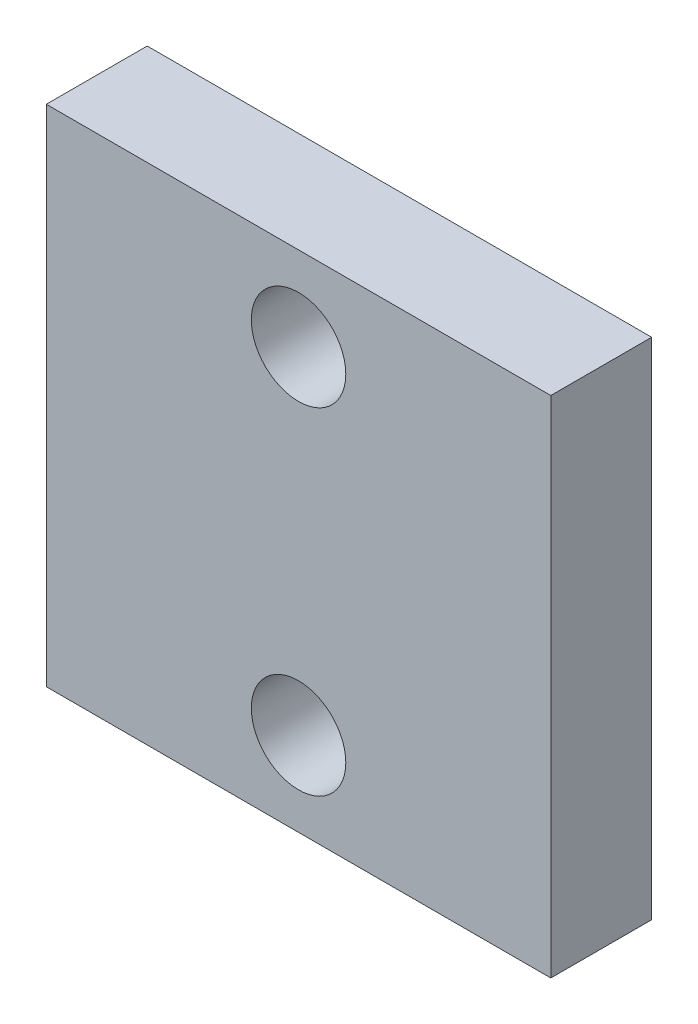
ISO-10303-21;
HEADER;
FILE_DESCRIPTION(('STEP AP214'),'2;1');
FILE_NAME('part.step','',(''),(''),'','','');
FILE_SCHEMA(('AUTOMOTIVE_DESIGN { 1 0 10303 214 1 1 1 1 }'));
ENDSEC;
DATA;
#1=APPLICATION_CONTEXT('core data for automotive mechanical design processes');
#2=APPLICATION_PROTOCOL_DEFINITION('international standard','automotive_design',2000,#1);
#3=PRODUCT_CONTEXT('',#1,'mechanical');
#4=PRODUCT('Part','Part','',(#3));
#5=PRODUCT_RELATED_PRODUCT_CATEGORY('part','',(#4));
#6=PRODUCT_DEFINITION_FORMATION('','',#4);
#7=PRODUCT_DEFINITION_CONTEXT('part definition',#1,'design');
#8=PRODUCT_DEFINITION('design','',#6,#7);
#9=PRODUCT_DEFINITION_SHAPE('','',#8);
#10=(LENGTH_UNIT() NAMED_UNIT(*) SI_UNIT(.MILLI.,.METRE.));
#11=(NAMED_UNIT(*) PLANE_ANGLE_UNIT() SI_UNIT($,.RADIAN.));
#12=(NAMED_UNIT(*) SI_UNIT($,.STERADIAN.) SOLID_ANGLE_UNIT());
#13=UNCERTAINTY_MEASURE_WITH_UNIT(LENGTH_MEASURE(1.E-05),#10,'distance_accuracy_value','');
#14=(GEOMETRIC_REPRESENTATION_CONTEXT(3) GLOBAL_UNCERTAINTY_ASSIGNED_CONTEXT((#13)) GLOBAL_UNIT_ASSIGNED_CONTEXT((#10,
#11,#12)) REPRESENTATION_CONTEXT('',''));
#15=CARTESIAN_POINT('',(0.,0.,0.));
#16=DIRECTION('',(0.,0.,1.));
#17=DIRECTION('',(1.,0.,0.));
#18=AXIS2_PLACEMENT_3D('',#15,#16,#17);
#19=CARTESIAN_POINT('',(0.,0.,12.));
#20=DIRECTION('',(0.,0.,-1.));
#21=DIRECTION('',(-1.,0.,0.));
#22=AXIS2_PLACEMENT_3D('',#19,#20,#21);
#23=PLANE('',#22);
#24=DIRECTION('',(0.,1.,0.));
#25=VECTOR('',#24,1.);
#26=CARTESIAN_POINT('',(30.,-30.,12.));
#27=LINE('',#26,#25);
#28=CARTESIAN_POINT('',(30.,-30.,12.));
#29=VERTEX_POINT('',#28);
#30=CARTESIAN_POINT('',(30.,30.,12.));
#31=VERTEX_POINT('',#30);
#32=EDGE_CURVE('E92',#29,#31,#27,.T.);
#33=ORIENTED_EDGE('',*,*,#32,.T.);
#34=DIRECTION('',(-1.,0.,0.));
#35=VECTOR('',#34,1.);
#36=CARTESIAN_POINT('',(-30.,30.,12.));
#37=LINE('',#36,#35);
#38=CARTESIAN_POINT('',(-30.,30.,12.));
#39=VERTEX_POINT('',#38);
#40=EDGE_CURVE('E87',#31,#39,#37,.T.);
#41=ORIENTED_EDGE('',*,*,#40,.T.);
#42=DIRECTION('',(0.,-1.,0.));
#43=VECTOR('',#42,1.);
#44=CARTESIAN_POINT('',(-30.,-30.,12.));
#45=LINE('',#44,#43);
#46=CARTESIAN_POINT('',(-30.,-30.,12.));
#47=VERTEX_POINT('',#46);
#48=EDGE_CURVE('E90',#39,#47,#45,.T.);
#49=ORIENTED_EDGE('',*,*,#48,.T.);
#50=DIRECTION('',(1.,0.,0.));
#51=VECTOR('',#50,1.);
#52=CARTESIAN_POINT('',(-30.,-30.,12.));
#53=LINE('',#52,#51);
#54=EDGE_CURVE('E57',#47,#29,#53,.T.);
#55=ORIENTED_EDGE('',*,*,#54,.T.);
#56=EDGE_LOOP('',(#33,#41,#49,#55));
#57=FACE_BOUND('',#56,.T.);
#58=CARTESIAN_POINT('',(0.,20.,12.));
#59=DIRECTION('',(0.,0.,1.));
#60=DIRECTION('',(1.,0.,0.));
#61=AXIS2_PLACEMENT_3D('',#58,#59,#60);
#62=CIRCLE('',#61,5.61862085023447);
#63=CARTESIAN_POINT('',(5.61862085023447,20.,12.));
#64=VERTEX_POINT('',#63);
#65=EDGE_CURVE('E112',#64,#64,#62,.T.);
#66=ORIENTED_EDGE('',*,*,#65,.F.);
#67=EDGE_LOOP('',(#66));
#68=FACE_BOUND('',#67,.T.);
#69=CARTESIAN_POINT('',(0.,-20.,12.));
#70=DIRECTION('',(0.,0.,1.));
#71=DIRECTION('',(1.,0.,0.));
#72=AXIS2_PLACEMENT_3D('',#69,#70,#71);
#73=CIRCLE('',#72,5.61862085023445);
#74=CARTESIAN_POINT('',(5.61862085023446,-20.,12.));
#75=VERTEX_POINT('',#74);
#76=EDGE_CURVE('E134',#75,#75,#73,.T.);
#77=ORIENTED_EDGE('',*,*,#76,.F.);
#78=EDGE_LOOP('',(#77));
#79=FACE_BOUND('',#78,.T.);
#80=ADVANCED_FACE('F39',(#57,#68,#79),#23,.F.);
#81=CARTESIAN_POINT('',(0.,0.,0.));
#82=DIRECTION('',(0.,0.,-1.));
#83=DIRECTION('',(-1.,0.,0.));
#84=AXIS2_PLACEMENT_3D('',#81,#82,#83);
#85=PLANE('',#84);
#86=CARTESIAN_POINT('',(0.,20.,0.));
#87=DIRECTION('',(0.,0.,1.));
#88=DIRECTION('',(1.,0.,0.));
#89=AXIS2_PLACEMENT_3D('',#86,#87,#88);
#90=CIRCLE('',#89,5.61862085023447);
#91=CARTESIAN_POINT('',(5.61862085023447,20.,0.));
#92=VERTEX_POINT('',#91);
#93=EDGE_CURVE('E130',#92,#92,#90,.T.);
#94=ORIENTED_EDGE('',*,*,#93,.T.);
#95=EDGE_LOOP('',(#94));
#96=FACE_BOUND('',#95,.T.);
#97=DIRECTION('',(0.,1.,0.));
#98=VECTOR('',#97,1.);
#99=CARTESIAN_POINT('',(30.,-30.,0.));
#100=LINE('',#99,#98);
#101=CARTESIAN_POINT('',(30.,-30.,0.));
#102=VERTEX_POINT('',#101);
#103=CARTESIAN_POINT('',(30.,30.,0.));
#104=VERTEX_POINT('',#103);
#105=EDGE_CURVE('E108',#102,#104,#100,.T.);
#106=ORIENTED_EDGE('',*,*,#105,.F.);
#107=DIRECTION('',(1.,0.,0.));
#108=VECTOR('',#107,1.);
#109=CARTESIAN_POINT('',(-30.,-30.,0.));
#110=LINE('',#109,#108);
#111=CARTESIAN_POINT('',(-30.,-30.,0.));
#112=VERTEX_POINT('',#111);
#113=EDGE_CURVE('E80',#112,#102,#110,.T.);
#114=ORIENTED_EDGE('',*,*,#113,.F.);
#115=DIRECTION('',(0.,-1.,0.));
#116=VECTOR('',#115,1.);
#117=CARTESIAN_POINT('',(-30.,-30.,0.));
#118=LINE('',#117,#116);
#119=CARTESIAN_POINT('',(-30.,30.,0.));
#120=VERTEX_POINT('',#119);
#121=EDGE_CURVE('E74',#120,#112,#118,.T.);
#122=ORIENTED_EDGE('',*,*,#121,.F.);
#123=DIRECTION('',(-1.,0.,0.));
#124=VECTOR('',#123,1.);
#125=CARTESIAN_POINT('',(-30.,30.,0.));
#126=LINE('',#125,#124);
#127=EDGE_CURVE('E97',#104,#120,#126,.T.);
#128=ORIENTED_EDGE('',*,*,#127,.F.);
#129=EDGE_LOOP('',(#106,#114,#122,#128));
#130=FACE_BOUND('',#129,.T.);
#131=CARTESIAN_POINT('',(0.,-20.,0.));
#132=DIRECTION('',(0.,0.,1.));
#133=DIRECTION('',(1.,0.,0.));
#134=AXIS2_PLACEMENT_3D('',#131,#132,#133);
#135=CIRCLE('',#134,5.61862085023445);
#136=CARTESIAN_POINT('',(5.61862085023446,-20.,0.));
#137=VERTEX_POINT('',#136);
#138=EDGE_CURVE('E138',#137,#137,#135,.T.);
#139=ORIENTED_EDGE('',*,*,#138,.T.);
#140=EDGE_LOOP('',(#139));
#141=FACE_BOUND('',#140,.T.);
#142=ADVANCED_FACE('F125',(#96,#130,#141),#85,.T.);
#143=CARTESIAN_POINT('',(30.,-30.,12.));
#144=DIRECTION('',(-1.,0.,0.));
#145=DIRECTION('',(0.,0.,1.));
#146=AXIS2_PLACEMENT_3D('',#143,#144,#145);
#147=PLANE('',#146);
#148=ORIENTED_EDGE('',*,*,#105,.T.);
#149=DIRECTION('',(0.,0.,-1.));
#150=VECTOR('',#149,1.);
#151=CARTESIAN_POINT('',(30.,30.,12.));
#152=LINE('',#151,#150);
#153=EDGE_CURVE('E11',#31,#104,#152,.T.);
#154=ORIENTED_EDGE('',*,*,#153,.F.);
#155=ORIENTED_EDGE('',*,*,#32,.F.);
#156=DIRECTION('',(0.,0.,-1.));
#157=VECTOR('',#156,1.);
#158=CARTESIAN_POINT('',(30.,-30.,12.));
#159=LINE('',#158,#157);
#160=EDGE_CURVE('E104',#29,#102,#159,.T.);
#161=ORIENTED_EDGE('',*,*,#160,.T.);
#162=EDGE_LOOP('',(#148,#154,#155,#161));
#163=FACE_BOUND('',#162,.T.);
#164=ADVANCED_FACE('F41',(#163),#147,.F.);
#165=CARTESIAN_POINT('',(-30.,30.,12.));
#166=DIRECTION('',(0.,-1.,0.));
#167=DIRECTION('',(0.,0.,-1.));
#168=AXIS2_PLACEMENT_3D('',#165,#166,#167);
#169=PLANE('',#168);
#170=ORIENTED_EDGE('',*,*,#127,.T.);
#171=DIRECTION('',(0.,0.,-1.));
#172=VECTOR('',#171,1.);
#173=CARTESIAN_POINT('',(-30.,30.,12.));
#174=LINE('',#173,#172);
#175=EDGE_CURVE('E49',#39,#120,#174,.T.);
#176=ORIENTED_EDGE('',*,*,#175,.F.);
#177=ORIENTED_EDGE('',*,*,#40,.F.);
#178=ORIENTED_EDGE('',*,*,#153,.T.);
#179=EDGE_LOOP('',(#170,#176,#177,#178));
#180=FACE_BOUND('',#179,.T.);
#181=ADVANCED_FACE('F96',(#180),#169,.F.);
#182=CARTESIAN_POINT('',(-30.,-30.,12.));
#183=DIRECTION('',(1.,0.,0.));
#184=DIRECTION('',(0.,0.,-1.));
#185=AXIS2_PLACEMENT_3D('',#182,#183,#184);
#186=PLANE('',#185);
#187=ORIENTED_EDGE('',*,*,#121,.T.);
#188=DIRECTION('',(0.,0.,-1.));
#189=VECTOR('',#188,1.);
#190=CARTESIAN_POINT('',(-30.,-30.,12.));
#191=LINE('',#190,#189);
#192=EDGE_CURVE('E99',#47,#112,#191,.T.);
#193=ORIENTED_EDGE('',*,*,#192,.F.);
#194=ORIENTED_EDGE('',*,*,#48,.F.);
#195=ORIENTED_EDGE('',*,*,#175,.T.);
#196=EDGE_LOOP('',(#187,#193,#194,#195));
#197=FACE_BOUND('',#196,.T.);
#198=ADVANCED_FACE('F100',(#197),#186,.F.);
#199=CARTESIAN_POINT('',(-30.,-30.,12.));
#200=DIRECTION('',(0.,1.,0.));
#201=DIRECTION('',(0.,0.,1.));
#202=AXIS2_PLACEMENT_3D('',#199,#200,#201);
#203=PLANE('',#202);
#204=ORIENTED_EDGE('',*,*,#113,.T.);
#205=ORIENTED_EDGE('',*,*,#160,.F.);
#206=ORIENTED_EDGE('',*,*,#54,.F.);
#207=ORIENTED_EDGE('',*,*,#192,.T.);
#208=EDGE_LOOP('',(#204,#205,#206,#207));
#209=FACE_BOUND('',#208,.T.);
#210=ADVANCED_FACE('F122',(#209),#203,.F.);
#211=CARTESIAN_POINT('',(0.,20.,12.));
#212=DIRECTION('',(0.,0.,-1.));
#213=DIRECTION('',(-1.,0.,0.));
#214=AXIS2_PLACEMENT_3D('',#211,#212,#213);
#215=CYLINDRICAL_SURFACE('',#214,5.61862085023447);
#216=ORIENTED_EDGE('',*,*,#65,.T.);
#217=EDGE_LOOP('',(#216));
#218=FACE_BOUND('',#217,.T.);
#219=ORIENTED_EDGE('',*,*,#93,.F.);
#220=EDGE_LOOP('',(#219));
#221=FACE_BOUND('',#220,.T.);
#222=ADVANCED_FACE('F157',(#218,#221),#215,.F.);
#223=CARTESIAN_POINT('',(0.,-20.,12.));
#224=DIRECTION('',(0.,0.,-1.));
#225=DIRECTION('',(-1.,0.,0.));
#226=AXIS2_PLACEMENT_3D('',#223,#224,#225);
#227=CYLINDRICAL_SURFACE('',#226,5.61862085023445);
#228=ORIENTED_EDGE('',*,*,#76,.T.);
#229=EDGE_LOOP('',(#228));
#230=FACE_BOUND('',#229,.T.);
#231=ORIENTED_EDGE('',*,*,#138,.F.);
#232=EDGE_LOOP('',(#231));
#233=FACE_BOUND('',#232,.T.);
#234=ADVANCED_FACE('F146',(#230,#233),#227,.F.);
#235=CLOSED_SHELL('',(#80,#142,#164,#181,#198,#210,#222,#234));
#236=MANIFOLD_SOLID_BREP('B2',#235);
#237=ADVANCED_BREP_SHAPE_REPRESENTATION('',(#18,#236),#14);
#238=SHAPE_DEFINITION_REPRESENTATION(#9,#237);
ENDSEC;
END-ISO-10303-21;
